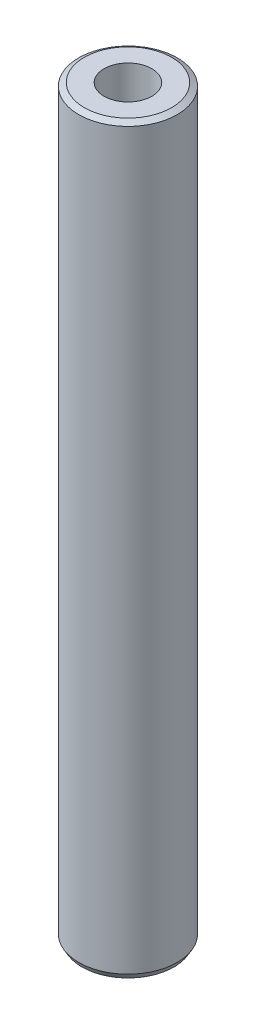
ISO-10303-21;
HEADER;
FILE_DESCRIPTION(('STEP AP214'),'2;1');
FILE_NAME('part.step','',(''),(''),'','','');
FILE_SCHEMA(('AUTOMOTIVE_DESIGN { 1 0 10303 214 1 1 1 1 }'));
ENDSEC;
DATA;
#1=APPLICATION_CONTEXT('core data for automotive mechanical design processes');
#2=APPLICATION_PROTOCOL_DEFINITION('international standard','automotive_design',2000,#1);
#3=PRODUCT_CONTEXT('',#1,'mechanical');
#4=PRODUCT('Part','Part','',(#3));
#5=PRODUCT_RELATED_PRODUCT_CATEGORY('part','',(#4));
#6=PRODUCT_DEFINITION_FORMATION('','',#4);
#7=PRODUCT_DEFINITION_CONTEXT('part definition',#1,'design');
#8=PRODUCT_DEFINITION('design','',#6,#7);
#9=PRODUCT_DEFINITION_SHAPE('','',#8);
#10=(LENGTH_UNIT() NAMED_UNIT(*) SI_UNIT(.MILLI.,.METRE.));
#11=(NAMED_UNIT(*) PLANE_ANGLE_UNIT() SI_UNIT($,.RADIAN.));
#12=(NAMED_UNIT(*) SI_UNIT($,.STERADIAN.) SOLID_ANGLE_UNIT());
#13=UNCERTAINTY_MEASURE_WITH_UNIT(LENGTH_MEASURE(1.E-05),#10,'distance_accuracy_value','');
#14=(GEOMETRIC_REPRESENTATION_CONTEXT(3) GLOBAL_UNCERTAINTY_ASSIGNED_CONTEXT((#13)) GLOBAL_UNIT_ASSIGNED_CONTEXT((#10,
#11,#12)) REPRESENTATION_CONTEXT('',''));
#15=CARTESIAN_POINT('',(0.,0.,0.));
#16=DIRECTION('',(0.,0.,1.));
#17=DIRECTION('',(1.,0.,0.));
#18=AXIS2_PLACEMENT_3D('',#15,#16,#17);
#19=CARTESIAN_POINT('',(0.,565.74086205803,0.));
#20=DIRECTION('',(0.,-1.,0.));
#21=DIRECTION('',(0.,0.,-1.));
#22=AXIS2_PLACEMENT_3D('',#19,#20,#21);
#23=CYLINDRICAL_SURFACE('',#22,37.5);
#24=CARTESIAN_POINT('',(0.,563.283861848836,0.));
#25=DIRECTION('',(0.,1.,0.));
#26=DIRECTION('',(0.,0.,1.));
#27=AXIS2_PLACEMENT_3D('',#24,#25,#26);
#28=CIRCLE('',#27,37.5);
#29=CARTESIAN_POINT('',(0.,563.283861848836,37.5));
#30=VERTEX_POINT('',#29);
#31=EDGE_CURVE('E50',#30,#30,#28,.F.);
#32=ORIENTED_EDGE('',*,*,#31,.T.);
#33=EDGE_LOOP('',(#32));
#34=FACE_BOUND('',#33,.T.);
#35=CARTESIAN_POINT('',(0.,4.25564919653088,0.));
#36=DIRECTION('',(0.,1.,0.));
#37=DIRECTION('',(0.,0.,1.));
#38=AXIS2_PLACEMENT_3D('',#35,#36,#37);
#39=CIRCLE('',#38,37.5);
#40=CARTESIAN_POINT('',(0.,4.25564919653088,37.5));
#41=VERTEX_POINT('',#40);
#42=EDGE_CURVE('E51',#41,#41,#39,.T.);
#43=ORIENTED_EDGE('',*,*,#42,.T.);
#44=EDGE_LOOP('',(#43));
#45=FACE_BOUND('',#44,.T.);
#46=ADVANCED_FACE('F39',(#34,#45),#23,.T.);
#47=CARTESIAN_POINT('',(0.,565.74086205803,0.));
#48=DIRECTION('',(0.,1.,0.));
#49=DIRECTION('',(0.,0.,1.));
#50=AXIS2_PLACEMENT_3D('',#47,#48,#49);
#51=PLANE('',#50);
#52=CARTESIAN_POINT('',(0.,565.74086205803,0.));
#53=DIRECTION('',(0.,1.,0.));
#54=DIRECTION('',(0.,0.,1.));
#55=AXIS2_PLACEMENT_3D('',#52,#53,#54);
#56=CIRCLE('',#55,33.2443508034694);
#57=CARTESIAN_POINT('',(0.,565.74086205803,33.2443508034694));
#58=VERTEX_POINT('',#57);
#59=EDGE_CURVE('E54',#58,#58,#56,.T.);
#60=ORIENTED_EDGE('',*,*,#59,.T.);
#61=EDGE_LOOP('',(#60));
#62=FACE_BOUND('',#61,.T.);
#63=CARTESIAN_POINT('',(0.,565.74086205803,0.));
#64=DIRECTION('',(0.,1.,0.));
#65=DIRECTION('',(0.,0.,1.));
#66=AXIS2_PLACEMENT_3D('',#63,#64,#65);
#67=CIRCLE('',#66,18.2049476194258);
#68=CARTESIAN_POINT('',(0.,565.74086205803,18.2049476194258));
#69=VERTEX_POINT('',#68);
#70=EDGE_CURVE('E58',#69,#69,#67,.T.);
#71=ORIENTED_EDGE('',*,*,#70,.F.);
#72=EDGE_LOOP('',(#71));
#73=FACE_BOUND('',#72,.T.);
#74=ADVANCED_FACE('F69',(#62,#73),#51,.T.);
#75=CARTESIAN_POINT('',(0.,0.,0.));
#76=DIRECTION('',(0.,1.,0.));
#77=DIRECTION('',(0.,0.,1.));
#78=AXIS2_PLACEMENT_3D('',#75,#76,#77);
#79=PLANE('',#78);
#80=CARTESIAN_POINT('',(0.,0.,0.));
#81=DIRECTION('',(0.,1.,0.));
#82=DIRECTION('',(0.,0.,1.));
#83=AXIS2_PLACEMENT_3D('',#80,#81,#82);
#84=CIRCLE('',#83,35.0429997908063);
#85=CARTESIAN_POINT('',(0.,0.,35.0429997908063));
#86=VERTEX_POINT('',#85);
#87=EDGE_CURVE('E10',#86,#86,#84,.F.);
#88=ORIENTED_EDGE('',*,*,#87,.T.);
#89=EDGE_LOOP('',(#88));
#90=FACE_BOUND('',#89,.T.);
#91=CARTESIAN_POINT('',(0.,0.,0.));
#92=DIRECTION('',(0.,1.,0.));
#93=DIRECTION('',(0.,0.,1.));
#94=AXIS2_PLACEMENT_3D('',#91,#92,#93);
#95=CIRCLE('',#94,18.2049476194258);
#96=CARTESIAN_POINT('',(0.,0.,18.2049476194258));
#97=VERTEX_POINT('',#96);
#98=EDGE_CURVE('E63',#97,#97,#95,.T.);
#99=ORIENTED_EDGE('',*,*,#98,.T.);
#100=EDGE_LOOP('',(#99));
#101=FACE_BOUND('',#100,.T.);
#102=ADVANCED_FACE('F75',(#90,#101),#79,.F.);
#103=CARTESIAN_POINT('',(0.,565.74086205803,0.));
#104=DIRECTION('',(0.,-1.,0.));
#105=DIRECTION('',(0.,0.,-1.));
#106=AXIS2_PLACEMENT_3D('',#103,#104,#105);
#107=CYLINDRICAL_SURFACE('',#106,18.2049476194258);
#108=ORIENTED_EDGE('',*,*,#70,.T.);
#109=EDGE_LOOP('',(#108));
#110=FACE_BOUND('',#109,.T.);
#111=ORIENTED_EDGE('',*,*,#98,.F.);
#112=EDGE_LOOP('',(#111));
#113=FACE_BOUND('',#112,.T.);
#114=ADVANCED_FACE('F70',(#110,#113),#107,.F.);
#115=CARTESIAN_POINT('',(0.,565.74086205803,0.));
#116=DIRECTION('',(0.,-1.,0.));
#117=DIRECTION('',(0.,0.,-1.));
#118=AXIS2_PLACEMENT_3D('',#115,#116,#117);
#119=CONICAL_SURFACE('',#118,33.2443508034694,1.04719755119661);
#120=ORIENTED_EDGE('',*,*,#31,.F.);
#121=EDGE_LOOP('',(#120));
#122=FACE_BOUND('',#121,.T.);
#123=ORIENTED_EDGE('',*,*,#59,.F.);
#124=EDGE_LOOP('',(#123));
#125=FACE_BOUND('',#124,.T.);
#126=ADVANCED_FACE('F81',(#122,#125),#119,.T.);
#127=CARTESIAN_POINT('',(0.,4.25564919653088,0.));
#128=DIRECTION('',(0.,1.,0.));
#129=DIRECTION('',(0.,0.,1.));
#130=AXIS2_PLACEMENT_3D('',#127,#128,#129);
#131=CONICAL_SURFACE('',#130,37.5,0.523598775598302);
#132=ORIENTED_EDGE('',*,*,#87,.F.);
#133=EDGE_LOOP('',(#132));
#134=FACE_BOUND('',#133,.T.);
#135=ORIENTED_EDGE('',*,*,#42,.F.);
#136=EDGE_LOOP('',(#135));
#137=FACE_BOUND('',#136,.T.);
#138=ADVANCED_FACE('F45',(#134,#137),#131,.T.);
#139=CLOSED_SHELL('',(#46,#74,#102,#114,#126,#138));
#140=MANIFOLD_SOLID_BREP('B2',#139);
#141=ADVANCED_BREP_SHAPE_REPRESENTATION('',(#18,#140),#14);
#142=SHAPE_DEFINITION_REPRESENTATION(#9,#141);
ENDSEC;
END-ISO-10303-21;
